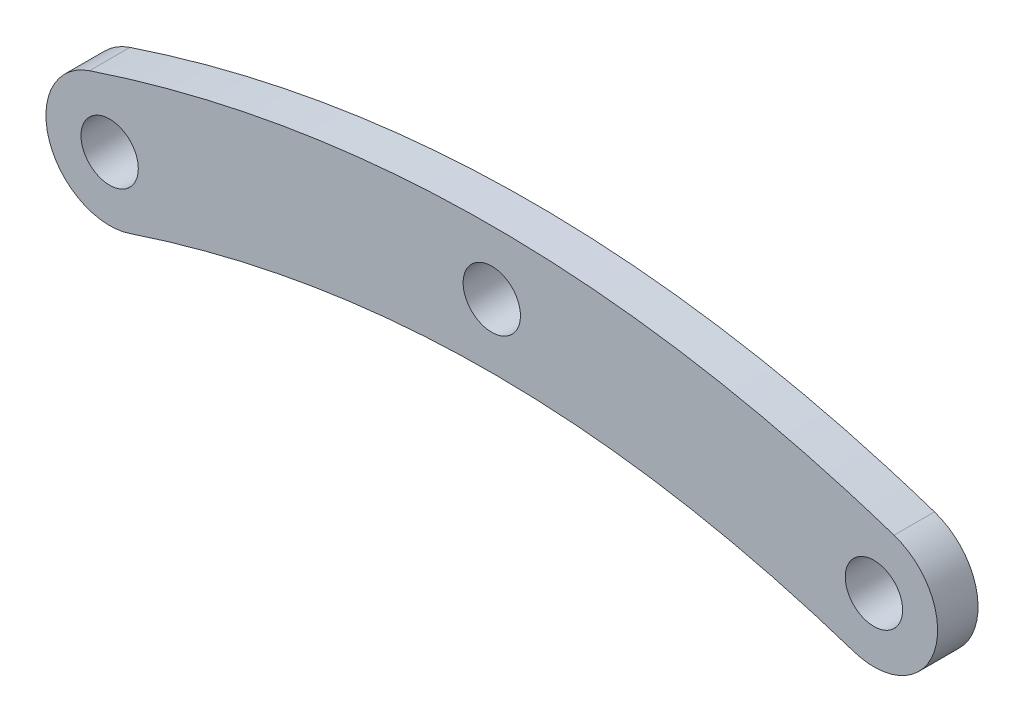
ISO-10303-21;
HEADER;
FILE_DESCRIPTION(('STEP AP214'),'2;1');
FILE_NAME('part.step','',(''),(''),'','','');
FILE_SCHEMA(('AUTOMOTIVE_DESIGN { 1 0 10303 214 1 1 1 1 }'));
ENDSEC;
DATA;
#1=APPLICATION_CONTEXT('core data for automotive mechanical design processes');
#2=APPLICATION_PROTOCOL_DEFINITION('international standard','automotive_design',2000,#1);
#3=PRODUCT_CONTEXT('',#1,'mechanical');
#4=PRODUCT('Part','Part','',(#3));
#5=PRODUCT_RELATED_PRODUCT_CATEGORY('part','',(#4));
#6=PRODUCT_DEFINITION_FORMATION('','',#4);
#7=PRODUCT_DEFINITION_CONTEXT('part definition',#1,'design');
#8=PRODUCT_DEFINITION('design','',#6,#7);
#9=PRODUCT_DEFINITION_SHAPE('','',#8);
#10=(LENGTH_UNIT() NAMED_UNIT(*) SI_UNIT(.MILLI.,.METRE.));
#11=(NAMED_UNIT(*) PLANE_ANGLE_UNIT() SI_UNIT($,.RADIAN.));
#12=(NAMED_UNIT(*) SI_UNIT($,.STERADIAN.) SOLID_ANGLE_UNIT());
#13=UNCERTAINTY_MEASURE_WITH_UNIT(LENGTH_MEASURE(1.E-05),#10,'distance_accuracy_value','');
#14=(GEOMETRIC_REPRESENTATION_CONTEXT(3) GLOBAL_UNCERTAINTY_ASSIGNED_CONTEXT((#13)) GLOBAL_UNIT_ASSIGNED_CONTEXT((#10,
#11,#12)) REPRESENTATION_CONTEXT('',''));
#15=CARTESIAN_POINT('',(0.,0.,0.));
#16=DIRECTION('',(0.,0.,1.));
#17=DIRECTION('',(1.,0.,0.));
#18=AXIS2_PLACEMENT_3D('',#15,#16,#17);
#19=CARTESIAN_POINT('',(-31.5811388300842,-0.25658350974743,1.5875));
#20=CARTESIAN_POINT('',(-19.7887170711887,3.67886201643878,1.5875));
#21=CARTESIAN_POINT('',(0.,5.3302844958903,1.5875));
#22=CARTESIAN_POINT('',(19.7887170711887,3.67886201643878,1.5875));
#23=CARTESIAN_POINT('',(31.5811388300842,-0.25658350974743,1.5875));
#24=B_SPLINE_CURVE_WITH_KNOTS('',2,(#19,#20,#21,#22,#23),.UNSPECIFIED.,.F.,.F.,(3,1,1,3),(0.,
0.375,0.625,1.),.UNSPECIFIED.);
#25=DIRECTION('',(0.,0.,-1.));
#26=VECTOR('',#25,1.);
#27=SURFACE_OF_LINEAR_EXTRUSION('',#24,#26);
#28=CARTESIAN_POINT('',(-31.5811388300842,-0.25658350974743,-1.5875));
#29=CARTESIAN_POINT('',(-19.7887170711887,3.67886201643878,-1.5875));
#30=CARTESIAN_POINT('',(0.,5.3302844958903,-1.5875));
#31=CARTESIAN_POINT('',(19.7887170711887,3.67886201643878,-1.5875));
#32=CARTESIAN_POINT('',(31.5811388300842,-0.25658350974743,-1.5875));
#33=B_SPLINE_CURVE_WITH_KNOTS('',2,(#28,#29,#30,#31,#32),.UNSPECIFIED.,.F.,.F.,(3,1,1,3),(0.,
0.375,0.625,1.),.UNSPECIFIED.);
#34=CARTESIAN_POINT('',(-31.5811388300842,-0.256583509747433,-1.5875));
#35=VERTEX_POINT('',#34);
#36=CARTESIAN_POINT('',(31.5811388300842,-0.256583509747432,-1.5875));
#37=VERTEX_POINT('',#36);
#38=EDGE_CURVE('E128',#35,#37,#33,.T.);
#39=ORIENTED_EDGE('',*,*,#38,.F.);
#40=DIRECTION('',(0.,0.,-1.));
#41=VECTOR('',#40,1.);
#42=CARTESIAN_POINT('',(-31.5811388300842,-0.256583509747433,1.5875));
#43=LINE('',#42,#41);
#44=CARTESIAN_POINT('',(-31.5811388300842,-0.256583509747433,1.5875));
#45=VERTEX_POINT('',#44);
#46=EDGE_CURVE('E11',#45,#35,#43,.T.);
#47=ORIENTED_EDGE('',*,*,#46,.F.);
#48=CARTESIAN_POINT('',(31.5811388300842,-0.256583509747432,1.5875));
#49=VERTEX_POINT('',#48);
#50=EDGE_CURVE('E101',#45,#49,#24,.T.);
#51=ORIENTED_EDGE('',*,*,#50,.T.);
#52=DIRECTION('',(0.,0.,-1.));
#53=VECTOR('',#52,1.);
#54=CARTESIAN_POINT('',(31.5811388300842,-0.256583509747432,1.5875));
#55=LINE('',#54,#53);
#56=EDGE_CURVE('E82',#49,#37,#55,.T.);
#57=ORIENTED_EDGE('',*,*,#56,.T.);
#58=EDGE_LOOP('',(#39,#47,#51,#57));
#59=FACE_BOUND('',#58,.T.);
#60=ADVANCED_FACE('F43',(#59),#27,.T.);
#61=CARTESIAN_POINT('',(-30.,-5.,1.5875));
#62=DIRECTION('',(0.,0.,-1.));
#63=DIRECTION('',(-1.,0.,0.));
#64=AXIS2_PLACEMENT_3D('',#61,#62,#63);
#65=CYLINDRICAL_SURFACE('',#64,5.);
#66=CARTESIAN_POINT('',(-30.,-5.,-1.5875));
#67=DIRECTION('',(0.,0.,1.));
#68=DIRECTION('',(1.,0.,0.));
#69=AXIS2_PLACEMENT_3D('',#66,#67,#68);
#70=CIRCLE('',#69,5.);
#71=CARTESIAN_POINT('',(-28.4188611699158,-9.74341649025257,-1.5875));
#72=VERTEX_POINT('',#71);
#73=EDGE_CURVE('E95',#72,#35,#70,.F.);
#74=ORIENTED_EDGE('',*,*,#73,.F.);
#75=DIRECTION('',(0.,0.,-1.));
#76=VECTOR('',#75,1.);
#77=CARTESIAN_POINT('',(-28.4188611699158,-9.74341649025257,1.5875));
#78=LINE('',#77,#76);
#79=CARTESIAN_POINT('',(-28.4188611699158,-9.74341649025257,1.5875));
#80=VERTEX_POINT('',#79);
#81=EDGE_CURVE('E52',#80,#72,#78,.T.);
#82=ORIENTED_EDGE('',*,*,#81,.F.);
#83=CARTESIAN_POINT('',(-30.,-5.,1.5875));
#84=DIRECTION('',(0.,0.,1.));
#85=DIRECTION('',(1.,0.,0.));
#86=AXIS2_PLACEMENT_3D('',#83,#84,#85);
#87=CIRCLE('',#86,5.);
#88=EDGE_CURVE('E93',#80,#45,#87,.F.);
#89=ORIENTED_EDGE('',*,*,#88,.T.);
#90=ORIENTED_EDGE('',*,*,#46,.T.);
#91=EDGE_LOOP('',(#74,#82,#89,#90));
#92=FACE_BOUND('',#91,.T.);
#93=ADVANCED_FACE('F91',(#92),#65,.T.);
#94=CARTESIAN_POINT('',(-28.4188611699158,-9.74341649025257,1.5875));
#95=CARTESIAN_POINT('',(-17.7112829288113,-6.17886201643878,1.5875));
#96=CARTESIAN_POINT('',(0.,-4.70528449589031,1.5875));
#97=CARTESIAN_POINT('',(17.7112829288113,-6.17886201643878,1.5875));
#98=CARTESIAN_POINT('',(28.4188611699158,-9.74341649025257,1.5875));
#99=B_SPLINE_CURVE_WITH_KNOTS('',2,(#94,#95,#96,#97,#98),.UNSPECIFIED.,.F.,.F.,(3,1,1,3),(0.,
0.375,0.625,1.),.UNSPECIFIED.);
#100=DIRECTION('',(0.,0.,-1.));
#101=VECTOR('',#100,1.);
#102=SURFACE_OF_LINEAR_EXTRUSION('',#99,#101);
#103=CARTESIAN_POINT('',(-28.4188611699158,-9.74341649025257,-1.5875));
#104=CARTESIAN_POINT('',(-17.7112829288113,-6.17886201643878,-1.5875));
#105=CARTESIAN_POINT('',(0.,-4.70528449589031,-1.5875));
#106=CARTESIAN_POINT('',(17.7112829288113,-6.17886201643878,-1.5875));
#107=CARTESIAN_POINT('',(28.4188611699158,-9.74341649025257,-1.5875));
#108=B_SPLINE_CURVE_WITH_KNOTS('',2,(#103,#104,#105,#106,#107),.UNSPECIFIED.,.F.,.F.,(3,1,1,3),
(0.,0.375,0.625,1.),.UNSPECIFIED.);
#109=CARTESIAN_POINT('',(28.4188611699158,-9.74341649025257,-1.5875));
#110=VERTEX_POINT('',#109);
#111=EDGE_CURVE('E75',#72,#110,#108,.T.);
#112=ORIENTED_EDGE('',*,*,#111,.T.);
#113=DIRECTION('',(0.,0.,-1.));
#114=VECTOR('',#113,1.);
#115=CARTESIAN_POINT('',(28.4188611699158,-9.74341649025257,1.5875));
#116=LINE('',#115,#114);
#117=CARTESIAN_POINT('',(28.4188611699158,-9.74341649025257,1.5875));
#118=VERTEX_POINT('',#117);
#119=EDGE_CURVE('E96',#118,#110,#116,.T.);
#120=ORIENTED_EDGE('',*,*,#119,.F.);
#121=EDGE_CURVE('E97',#80,#118,#99,.T.);
#122=ORIENTED_EDGE('',*,*,#121,.F.);
#123=ORIENTED_EDGE('',*,*,#81,.T.);
#124=EDGE_LOOP('',(#112,#120,#122,#123));
#125=FACE_BOUND('',#124,.T.);
#126=ADVANCED_FACE('F98',(#125),#102,.F.);
#127=CARTESIAN_POINT('',(30.,-5.,1.5875));
#128=DIRECTION('',(0.,0.,-1.));
#129=DIRECTION('',(-1.,0.,0.));
#130=AXIS2_PLACEMENT_3D('',#127,#128,#129);
#131=CYLINDRICAL_SURFACE('',#130,5.);
#132=CARTESIAN_POINT('',(30.,-5.,-1.5875));
#133=DIRECTION('',(0.,0.,1.));
#134=DIRECTION('',(1.,0.,0.));
#135=AXIS2_PLACEMENT_3D('',#132,#133,#134);
#136=CIRCLE('',#135,5.);
#137=EDGE_CURVE('E103',#110,#37,#136,.T.);
#138=ORIENTED_EDGE('',*,*,#137,.T.);
#139=ORIENTED_EDGE('',*,*,#56,.F.);
#140=CARTESIAN_POINT('',(30.,-5.,1.5875));
#141=DIRECTION('',(0.,0.,1.));
#142=DIRECTION('',(1.,0.,0.));
#143=AXIS2_PLACEMENT_3D('',#140,#141,#142);
#144=CIRCLE('',#143,5.);
#145=EDGE_CURVE('E60',#118,#49,#144,.T.);
#146=ORIENTED_EDGE('',*,*,#145,.F.);
#147=ORIENTED_EDGE('',*,*,#119,.T.);
#148=EDGE_LOOP('',(#138,#139,#146,#147));
#149=FACE_BOUND('',#148,.T.);
#150=ADVANCED_FACE('F119',(#149),#131,.T.);
#151=CARTESIAN_POINT('',(0.,0.,1.5875));
#152=DIRECTION('',(0.,0.,1.));
#153=DIRECTION('',(1.,0.,0.));
#154=AXIS2_PLACEMENT_3D('',#151,#152,#153);
#155=PLANE('',#154);
#156=CARTESIAN_POINT('',(-30.,-5.,1.5875));
#157=DIRECTION('',(0.,0.,1.));
#158=DIRECTION('',(1.,0.,0.));
#159=AXIS2_PLACEMENT_3D('',#156,#157,#158);
#160=CIRCLE('',#159,2.24999999999999);
#161=CARTESIAN_POINT('',(-27.75,-5.,1.5875));
#162=VERTEX_POINT('',#161);
#163=EDGE_CURVE('E177',#162,#162,#160,.T.);
#164=ORIENTED_EDGE('',*,*,#163,.F.);
#165=EDGE_LOOP('',(#164));
#166=FACE_BOUND('',#165,.T.);
#167=CARTESIAN_POINT('',(30.,-5.,1.5875));
#168=DIRECTION('',(0.,0.,1.));
#169=DIRECTION('',(1.,0.,0.));
#170=AXIS2_PLACEMENT_3D('',#167,#168,#169);
#171=CIRCLE('',#170,2.24999999999999);
#172=CARTESIAN_POINT('',(32.25,-5.,1.5875));
#173=VERTEX_POINT('',#172);
#174=EDGE_CURVE('E179',#173,#173,#171,.T.);
#175=ORIENTED_EDGE('',*,*,#174,.F.);
#176=EDGE_LOOP('',(#175));
#177=FACE_BOUND('',#176,.T.);
#178=CARTESIAN_POINT('',(0.,0.,1.5875));
#179=DIRECTION('',(0.,0.,1.));
#180=DIRECTION('',(1.,0.,0.));
#181=AXIS2_PLACEMENT_3D('',#178,#179,#180);
#182=CIRCLE('',#181,2.24999999999999);
#183=CARTESIAN_POINT('',(2.24999999999999,0.,1.5875));
#184=VERTEX_POINT('',#183);
#185=EDGE_CURVE('E187',#184,#184,#182,.T.);
#186=ORIENTED_EDGE('',*,*,#185,.F.);
#187=EDGE_LOOP('',(#186));
#188=FACE_BOUND('',#187,.T.);
#189=ORIENTED_EDGE('',*,*,#50,.F.);
#190=ORIENTED_EDGE('',*,*,#88,.F.);
#191=ORIENTED_EDGE('',*,*,#121,.T.);
#192=ORIENTED_EDGE('',*,*,#145,.T.);
#193=EDGE_LOOP('',(#189,#190,#191,#192));
#194=FACE_BOUND('',#193,.T.);
#195=ADVANCED_FACE('F100',(#166,#177,#188,#194),#155,.T.);
#196=CARTESIAN_POINT('',(0.,0.,-1.5875));
#197=DIRECTION('',(0.,0.,1.));
#198=DIRECTION('',(1.,0.,0.));
#199=AXIS2_PLACEMENT_3D('',#196,#197,#198);
#200=PLANE('',#199);
#201=CARTESIAN_POINT('',(-30.,-5.,-1.5875));
#202=DIRECTION('',(0.,0.,1.));
#203=DIRECTION('',(1.,0.,0.));
#204=AXIS2_PLACEMENT_3D('',#201,#202,#203);
#205=CIRCLE('',#204,2.25);
#206=CARTESIAN_POINT('',(-27.75,-5.,-1.5875));
#207=VERTEX_POINT('',#206);
#208=EDGE_CURVE('E175',#207,#207,#205,.T.);
#209=ORIENTED_EDGE('',*,*,#208,.T.);
#210=EDGE_LOOP('',(#209));
#211=FACE_BOUND('',#210,.T.);
#212=CARTESIAN_POINT('',(30.,-5.,-1.5875));
#213=DIRECTION('',(0.,0.,1.));
#214=DIRECTION('',(1.,0.,0.));
#215=AXIS2_PLACEMENT_3D('',#212,#213,#214);
#216=CIRCLE('',#215,2.25);
#217=CARTESIAN_POINT('',(32.25,-5.,-1.5875));
#218=VERTEX_POINT('',#217);
#219=EDGE_CURVE('E184',#218,#218,#216,.T.);
#220=ORIENTED_EDGE('',*,*,#219,.T.);
#221=EDGE_LOOP('',(#220));
#222=FACE_BOUND('',#221,.T.);
#223=CARTESIAN_POINT('',(0.,0.,-1.5875));
#224=DIRECTION('',(0.,0.,1.));
#225=DIRECTION('',(1.,0.,0.));
#226=AXIS2_PLACEMENT_3D('',#223,#224,#225);
#227=CIRCLE('',#226,2.25);
#228=CARTESIAN_POINT('',(2.25,0.,-1.5875));
#229=VERTEX_POINT('',#228);
#230=EDGE_CURVE('E131',#229,#229,#227,.T.);
#231=ORIENTED_EDGE('',*,*,#230,.T.);
#232=EDGE_LOOP('',(#231));
#233=FACE_BOUND('',#232,.T.);
#234=ORIENTED_EDGE('',*,*,#38,.T.);
#235=ORIENTED_EDGE('',*,*,#137,.F.);
#236=ORIENTED_EDGE('',*,*,#111,.F.);
#237=ORIENTED_EDGE('',*,*,#73,.T.);
#238=EDGE_LOOP('',(#234,#235,#236,#237));
#239=FACE_BOUND('',#238,.T.);
#240=ADVANCED_FACE('F132',(#211,#222,#233,#239),#200,.F.);
#241=CARTESIAN_POINT('',(0.,0.,1.5875));
#242=DIRECTION('',(0.,0.,1.));
#243=DIRECTION('',(1.,0.,0.));
#244=AXIS2_PLACEMENT_3D('',#241,#242,#243);
#245=CYLINDRICAL_SURFACE('',#244,2.24999999999999);
#246=ORIENTED_EDGE('',*,*,#230,.F.);
#247=EDGE_LOOP('',(#246));
#248=FACE_BOUND('',#247,.T.);
#249=ORIENTED_EDGE('',*,*,#185,.T.);
#250=EDGE_LOOP('',(#249));
#251=FACE_BOUND('',#250,.T.);
#252=ADVANCED_FACE('F155',(#248,#251),#245,.F.);
#253=CARTESIAN_POINT('',(30.,-5.,1.5875));
#254=DIRECTION('',(0.,0.,1.));
#255=DIRECTION('',(1.,0.,0.));
#256=AXIS2_PLACEMENT_3D('',#253,#254,#255);
#257=CYLINDRICAL_SURFACE('',#256,2.25);
#258=ORIENTED_EDGE('',*,*,#219,.F.);
#259=EDGE_LOOP('',(#258));
#260=FACE_BOUND('',#259,.T.);
#261=ORIENTED_EDGE('',*,*,#174,.T.);
#262=EDGE_LOOP('',(#261));
#263=FACE_BOUND('',#262,.T.);
#264=ADVANCED_FACE('F162',(#260,#263),#257,.F.);
#265=CARTESIAN_POINT('',(-30.,-5.,1.5875));
#266=DIRECTION('',(0.,0.,1.));
#267=DIRECTION('',(1.,0.,0.));
#268=AXIS2_PLACEMENT_3D('',#265,#266,#267);
#269=CYLINDRICAL_SURFACE('',#268,2.24999999999999);
#270=ORIENTED_EDGE('',*,*,#208,.F.);
#271=EDGE_LOOP('',(#270));
#272=FACE_BOUND('',#271,.T.);
#273=ORIENTED_EDGE('',*,*,#163,.T.);
#274=EDGE_LOOP('',(#273));
#275=FACE_BOUND('',#274,.T.);
#276=ADVANCED_FACE('F166',(#272,#275),#269,.F.);
#277=CLOSED_SHELL('',(#60,#93,#126,#150,#195,#240,#252,#264,#276));
#278=MANIFOLD_SOLID_BREP('B2',#277);
#279=ADVANCED_BREP_SHAPE_REPRESENTATION('',(#18,#278),#14);
#280=SHAPE_DEFINITION_REPRESENTATION(#9,#279);
ENDSEC;
END-ISO-10303-21;
